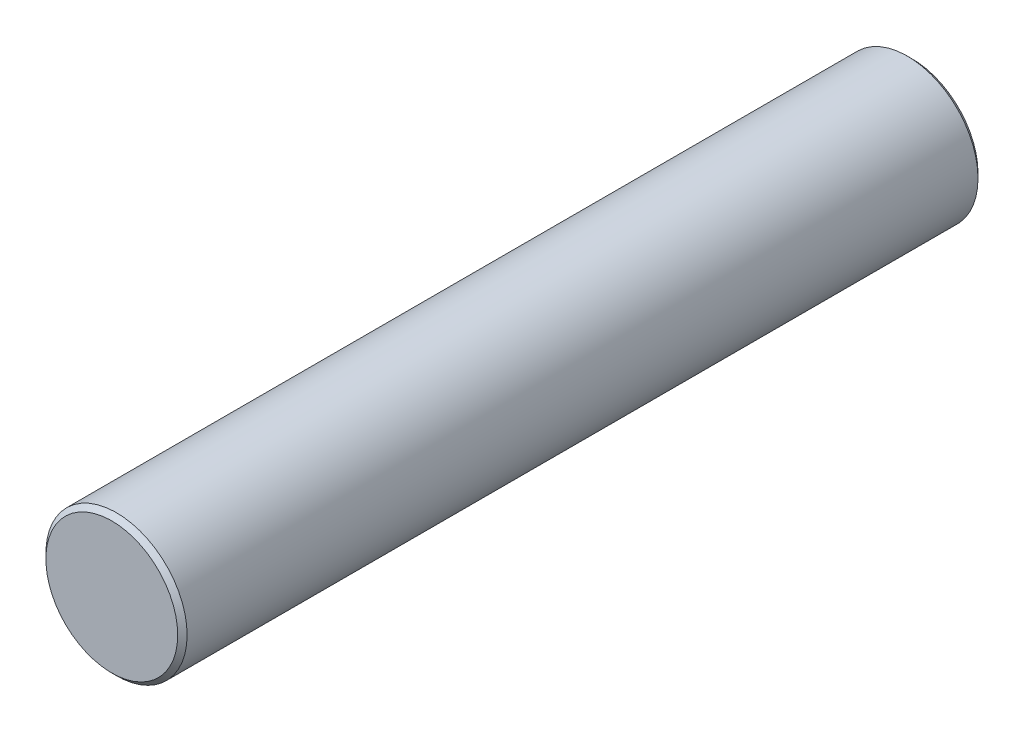
ISO-10303-21;
HEADER;
FILE_DESCRIPTION(('STEP AP214'),'2;1');
FILE_NAME('part.step','',(''),(''),'','','');
FILE_SCHEMA(('AUTOMOTIVE_DESIGN { 1 0 10303 214 1 1 1 1 }'));
ENDSEC;
DATA;
#1=APPLICATION_CONTEXT('core data for automotive mechanical design processes');
#2=APPLICATION_PROTOCOL_DEFINITION('international standard','automotive_design',2000,#1);
#3=PRODUCT_CONTEXT('',#1,'mechanical');
#4=PRODUCT('Part','Part','',(#3));
#5=PRODUCT_RELATED_PRODUCT_CATEGORY('part','',(#4));
#6=PRODUCT_DEFINITION_FORMATION('','',#4);
#7=PRODUCT_DEFINITION_CONTEXT('part definition',#1,'design');
#8=PRODUCT_DEFINITION('design','',#6,#7);
#9=PRODUCT_DEFINITION_SHAPE('','',#8);
#10=(LENGTH_UNIT() NAMED_UNIT(*) SI_UNIT(.MILLI.,.METRE.));
#11=(NAMED_UNIT(*) PLANE_ANGLE_UNIT() SI_UNIT($,.RADIAN.));
#12=(NAMED_UNIT(*) SI_UNIT($,.STERADIAN.) SOLID_ANGLE_UNIT());
#13=UNCERTAINTY_MEASURE_WITH_UNIT(LENGTH_MEASURE(1.E-05),#10,'distance_accuracy_value','');
#14=(GEOMETRIC_REPRESENTATION_CONTEXT(3) GLOBAL_UNCERTAINTY_ASSIGNED_CONTEXT((#13)) GLOBAL_UNIT_ASSIGNED_CONTEXT((#10,
#11,#12)) REPRESENTATION_CONTEXT('',''));
#15=CARTESIAN_POINT('',(0.,0.,0.));
#16=DIRECTION('',(0.,0.,1.));
#17=DIRECTION('',(1.,0.,0.));
#18=AXIS2_PLACEMENT_3D('',#15,#16,#17);
#19=CARTESIAN_POINT('',(0.,0.,170.));
#20=DIRECTION('',(0.,0.,-1.));
#21=DIRECTION('',(-1.,0.,0.));
#22=AXIS2_PLACEMENT_3D('',#19,#20,#21);
#23=CYLINDRICAL_SURFACE('',#22,15.);
#24=CARTESIAN_POINT('',(0.,0.,1.));
#25=DIRECTION('',(0.,0.,1.));
#26=DIRECTION('',(1.,0.,0.));
#27=AXIS2_PLACEMENT_3D('',#24,#25,#26);
#28=CIRCLE('',#27,15.);
#29=CARTESIAN_POINT('',(15.,0.,1.));
#30=VERTEX_POINT('',#29);
#31=EDGE_CURVE('E43',#30,#30,#28,.T.);
#32=ORIENTED_EDGE('',*,*,#31,.T.);
#33=EDGE_LOOP('',(#32));
#34=FACE_BOUND('',#33,.T.);
#35=CARTESIAN_POINT('',(0.,0.,169.));
#36=DIRECTION('',(0.,0.,1.));
#37=DIRECTION('',(1.,0.,0.));
#38=AXIS2_PLACEMENT_3D('',#35,#36,#37);
#39=CIRCLE('',#38,15.);
#40=CARTESIAN_POINT('',(15.,0.,169.));
#41=VERTEX_POINT('',#40);
#42=EDGE_CURVE('E47',#41,#41,#39,.F.);
#43=ORIENTED_EDGE('',*,*,#42,.T.);
#44=EDGE_LOOP('',(#43));
#45=FACE_BOUND('',#44,.T.);
#46=ADVANCED_FACE('F33',(#34,#45),#23,.T.);
#47=CARTESIAN_POINT('',(0.,0.,170.));
#48=DIRECTION('',(0.,0.,1.));
#49=DIRECTION('',(1.,0.,0.));
#50=AXIS2_PLACEMENT_3D('',#47,#48,#49);
#51=PLANE('',#50);
#52=CARTESIAN_POINT('',(0.,0.,170.));
#53=DIRECTION('',(0.,0.,1.));
#54=DIRECTION('',(1.,0.,0.));
#55=AXIS2_PLACEMENT_3D('',#52,#53,#54);
#56=CIRCLE('',#55,14.);
#57=CARTESIAN_POINT('',(14.,0.,170.));
#58=VERTEX_POINT('',#57);
#59=EDGE_CURVE('E10',#58,#58,#56,.T.);
#60=ORIENTED_EDGE('',*,*,#59,.T.);
#61=EDGE_LOOP('',(#60));
#62=FACE_BOUND('',#61,.T.);
#63=ADVANCED_FACE('F66',(#62),#51,.T.);
#64=CARTESIAN_POINT('',(0.,0.,0.));
#65=DIRECTION('',(0.,0.,1.));
#66=DIRECTION('',(1.,0.,0.));
#67=AXIS2_PLACEMENT_3D('',#64,#65,#66);
#68=PLANE('',#67);
#69=CARTESIAN_POINT('',(0.,0.,0.));
#70=DIRECTION('',(0.,0.,1.));
#71=DIRECTION('',(1.,0.,0.));
#72=AXIS2_PLACEMENT_3D('',#69,#70,#71);
#73=CIRCLE('',#72,14.);
#74=CARTESIAN_POINT('',(14.,0.,0.));
#75=VERTEX_POINT('',#74);
#76=EDGE_CURVE('E39',#75,#75,#73,.F.);
#77=ORIENTED_EDGE('',*,*,#76,.T.);
#78=EDGE_LOOP('',(#77));
#79=FACE_BOUND('',#78,.T.);
#80=ADVANCED_FACE('F62',(#79),#68,.F.);
#81=CARTESIAN_POINT('',(0.,0.,1.));
#82=DIRECTION('',(0.,0.,1.));
#83=DIRECTION('',(1.,0.,0.));
#84=AXIS2_PLACEMENT_3D('',#81,#82,#83);
#85=CONICAL_SURFACE('',#84,15.,0.785398163397446);
#86=ORIENTED_EDGE('',*,*,#76,.F.);
#87=EDGE_LOOP('',(#86));
#88=FACE_BOUND('',#87,.T.);
#89=ORIENTED_EDGE('',*,*,#31,.F.);
#90=EDGE_LOOP('',(#89));
#91=FACE_BOUND('',#90,.T.);
#92=ADVANCED_FACE('F57',(#88,#91),#85,.T.);
#93=CARTESIAN_POINT('',(0.,0.,170.));
#94=DIRECTION('',(0.,0.,-1.));
#95=DIRECTION('',(-1.,0.,0.));
#96=AXIS2_PLACEMENT_3D('',#93,#94,#95);
#97=CONICAL_SURFACE('',#96,14.,0.785398163397449);
#98=ORIENTED_EDGE('',*,*,#42,.F.);
#99=EDGE_LOOP('',(#98));
#100=FACE_BOUND('',#99,.T.);
#101=ORIENTED_EDGE('',*,*,#59,.F.);
#102=EDGE_LOOP('',(#101));
#103=FACE_BOUND('',#102,.T.);
#104=ADVANCED_FACE('F54',(#100,#103),#97,.T.);
#105=CLOSED_SHELL('',(#46,#63,#80,#92,#104));
#106=MANIFOLD_SOLID_BREP('B2',#105);
#107=ADVANCED_BREP_SHAPE_REPRESENTATION('',(#18,#106),#14);
#108=SHAPE_DEFINITION_REPRESENTATION(#9,#107);
ENDSEC;
END-ISO-10303-21;
